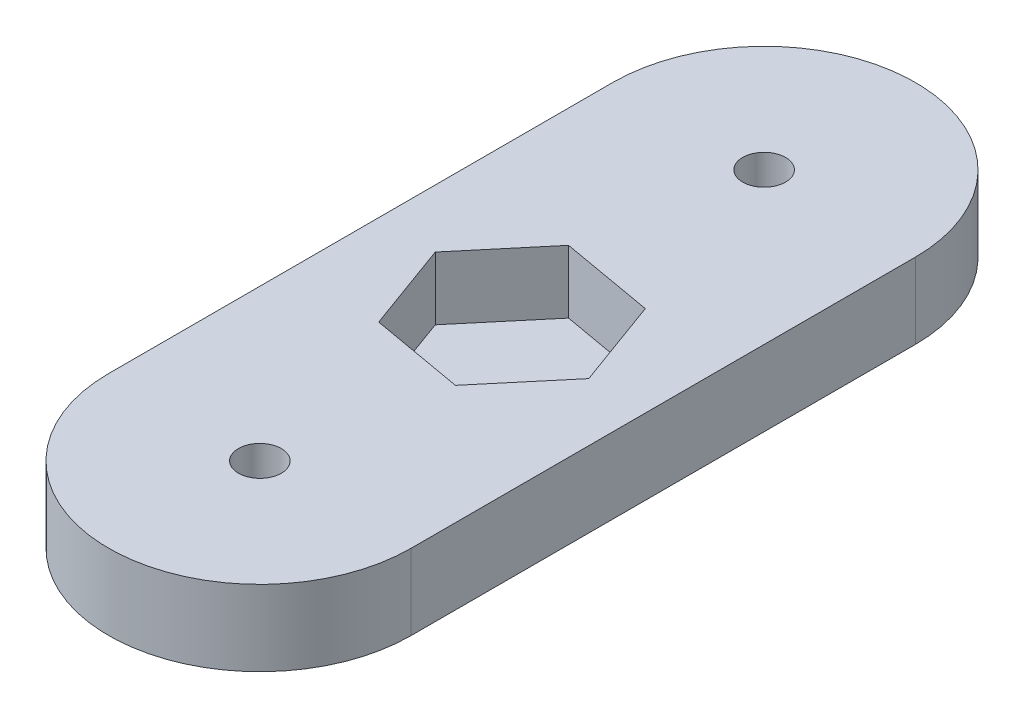
ISO-10303-21;
HEADER;
FILE_DESCRIPTION(('STEP AP214'),'2;1');
FILE_NAME('part.step','',(''),(''),'','','');
FILE_SCHEMA(('AUTOMOTIVE_DESIGN { 1 0 10303 214 1 1 1 1 }'));
ENDSEC;
DATA;
#1=APPLICATION_CONTEXT('core data for automotive mechanical design processes');
#2=APPLICATION_PROTOCOL_DEFINITION('international standard','automotive_design',2000,#1);
#3=PRODUCT_CONTEXT('',#1,'mechanical');
#4=PRODUCT('Part','Part','',(#3));
#5=PRODUCT_RELATED_PRODUCT_CATEGORY('part','',(#4));
#6=PRODUCT_DEFINITION_FORMATION('','',#4);
#7=PRODUCT_DEFINITION_CONTEXT('part definition',#1,'design');
#8=PRODUCT_DEFINITION('design','',#6,#7);
#9=PRODUCT_DEFINITION_SHAPE('','',#8);
#10=(LENGTH_UNIT() NAMED_UNIT(*) SI_UNIT(.MILLI.,.METRE.));
#11=(NAMED_UNIT(*) PLANE_ANGLE_UNIT() SI_UNIT($,.RADIAN.));
#12=(NAMED_UNIT(*) SI_UNIT($,.STERADIAN.) SOLID_ANGLE_UNIT());
#13=UNCERTAINTY_MEASURE_WITH_UNIT(LENGTH_MEASURE(1.E-05),#10,'distance_accuracy_value','');
#14=(GEOMETRIC_REPRESENTATION_CONTEXT(3) GLOBAL_UNCERTAINTY_ASSIGNED_CONTEXT((#13)) GLOBAL_UNIT_ASSIGNED_CONTEXT((#10,
#11,#12)) REPRESENTATION_CONTEXT('',''));
#15=CARTESIAN_POINT('',(0.,0.,0.));
#16=DIRECTION('',(0.,0.,1.));
#17=DIRECTION('',(1.,0.,0.));
#18=AXIS2_PLACEMENT_3D('',#15,#16,#17);
#19=CARTESIAN_POINT('',(0.,6.,0.));
#20=DIRECTION('',(0.,1.,0.));
#21=DIRECTION('',(0.,0.,1.));
#22=AXIS2_PLACEMENT_3D('',#19,#20,#21);
#23=PLANE('',#22);
#24=DIRECTION('',(0.984807753012209,0.,0.173648177666927));
#25=VECTOR('',#24,1.);
#26=CARTESIAN_POINT('',(-4.82447679329562,6.,-14.2504124492025));
#27=LINE('',#26,#25);
#28=CARTESIAN_POINT('',(-4.82447679329562,6.,-14.2504124492025));
#29=VERTEX_POINT('',#28);
#30=CARTESIAN_POINT('',(2.56705048362556,6.,-12.9470867616388));
#31=VERTEX_POINT('',#30);
#32=EDGE_CURVE('E48',#29,#31,#27,.T.);
#33=ORIENTED_EDGE('',*,*,#32,.F.);
#34=DIRECTION('',(0.342020143325672,0.,0.939692620785907));
#35=VECTOR('',#34,1.);
#36=CARTESIAN_POINT('',(-7.39152727692118,6.,-21.3033256875637));
#37=LINE('',#36,#35);
#38=CARTESIAN_POINT('',(-7.39152727692118,6.,-21.3033256875637));
#39=VERTEX_POINT('',#38);
#40=EDGE_CURVE('E140',#39,#29,#37,.T.);
#41=ORIENTED_EDGE('',*,*,#40,.F.);
#42=DIRECTION('',(-0.642787609686537,0.,0.76604444311898));
#43=VECTOR('',#42,1.);
#44=CARTESIAN_POINT('',(-2.56705048362556,6.,-27.0529132383612));
#45=LINE('',#44,#43);
#46=CARTESIAN_POINT('',(-2.56705048362556,6.,-27.0529132383612));
#47=VERTEX_POINT('',#46);
#48=EDGE_CURVE('E143',#47,#39,#45,.T.);
#49=ORIENTED_EDGE('',*,*,#48,.F.);
#50=DIRECTION('',(-0.984807753012209,0.,-0.173648177666927));
#51=VECTOR('',#50,1.);
#52=CARTESIAN_POINT('',(4.82447679329561,6.,-25.7495875507975));
#53=LINE('',#52,#51);
#54=CARTESIAN_POINT('',(4.82447679329561,6.,-25.7495875507975));
#55=VERTEX_POINT('',#54);
#56=EDGE_CURVE('E159',#55,#47,#53,.T.);
#57=ORIENTED_EDGE('',*,*,#56,.F.);
#58=DIRECTION('',(-0.342020143325672,0.,-0.939692620785907));
#59=VECTOR('',#58,1.);
#60=CARTESIAN_POINT('',(7.39152727692118,6.,-18.6966743124362));
#61=LINE('',#60,#59);
#62=CARTESIAN_POINT('',(7.39152727692118,6.,-18.6966743124362));
#63=VERTEX_POINT('',#62);
#64=EDGE_CURVE('E156',#63,#55,#61,.T.);
#65=ORIENTED_EDGE('',*,*,#64,.F.);
#66=DIRECTION('',(0.642787609686537,0.,-0.76604444311898));
#67=VECTOR('',#66,1.);
#68=CARTESIAN_POINT('',(2.56705048362556,6.,-12.9470867616388));
#69=LINE('',#68,#67);
#70=EDGE_CURVE('E154',#31,#63,#69,.T.);
#71=ORIENTED_EDGE('',*,*,#70,.F.);
#72=EDGE_LOOP('',(#33,#41,#49,#57,#65,#71));
#73=FACE_BOUND('',#72,.T.);
#74=CARTESIAN_POINT('',(0.,6.,-40.));
#75=DIRECTION('',(0.,1.,0.));
#76=DIRECTION('',(0.,0.,1.));
#77=AXIS2_PLACEMENT_3D('',#74,#75,#76);
#78=CIRCLE('',#77,1.7);
#79=CARTESIAN_POINT('',(0.,6.,-38.3));
#80=VERTEX_POINT('',#79);
#81=EDGE_CURVE('E180',#80,#80,#78,.T.);
#82=ORIENTED_EDGE('',*,*,#81,.F.);
#83=EDGE_LOOP('',(#82));
#84=FACE_BOUND('',#83,.T.);
#85=CARTESIAN_POINT('',(0.,6.,0.));
#86=DIRECTION('',(0.,1.,0.));
#87=DIRECTION('',(0.,0.,1.));
#88=AXIS2_PLACEMENT_3D('',#85,#86,#87);
#89=CIRCLE('',#88,12.);
#90=CARTESIAN_POINT('',(-12.,6.,0.));
#91=VERTEX_POINT('',#90);
#92=CARTESIAN_POINT('',(12.,6.,0.));
#93=VERTEX_POINT('',#92);
#94=EDGE_CURVE('E186',#91,#93,#89,.T.);
#95=ORIENTED_EDGE('',*,*,#94,.T.);
#96=DIRECTION('',(0.,0.,-1.));
#97=VECTOR('',#96,1.);
#98=CARTESIAN_POINT('',(12.,6.,0.));
#99=LINE('',#98,#97);
#100=CARTESIAN_POINT('',(12.,6.,-40.));
#101=VERTEX_POINT('',#100);
#102=EDGE_CURVE('E85',#93,#101,#99,.T.);
#103=ORIENTED_EDGE('',*,*,#102,.T.);
#104=CARTESIAN_POINT('',(0.,6.,-40.));
#105=DIRECTION('',(0.,1.,0.));
#106=DIRECTION('',(0.,0.,1.));
#107=AXIS2_PLACEMENT_3D('',#104,#105,#106);
#108=CIRCLE('',#107,12.);
#109=CARTESIAN_POINT('',(-12.,6.,-40.));
#110=VERTEX_POINT('',#109);
#111=EDGE_CURVE('E189',#101,#110,#108,.T.);
#112=ORIENTED_EDGE('',*,*,#111,.T.);
#113=DIRECTION('',(0.,0.,1.));
#114=VECTOR('',#113,1.);
#115=CARTESIAN_POINT('',(-12.,6.,0.));
#116=LINE('',#115,#114);
#117=EDGE_CURVE('E57',#110,#91,#116,.T.);
#118=ORIENTED_EDGE('',*,*,#117,.T.);
#119=EDGE_LOOP('',(#95,#103,#112,#118));
#120=FACE_BOUND('',#119,.T.);
#121=CARTESIAN_POINT('',(0.,6.,0.));
#122=DIRECTION('',(0.,1.,0.));
#123=DIRECTION('',(0.,0.,1.));
#124=AXIS2_PLACEMENT_3D('',#121,#122,#123);
#125=CIRCLE('',#124,1.7);
#126=CARTESIAN_POINT('',(0.,6.,1.7));
#127=VERTEX_POINT('',#126);
#128=EDGE_CURVE('E174',#127,#127,#125,.T.);
#129=ORIENTED_EDGE('',*,*,#128,.F.);
#130=EDGE_LOOP('',(#129));
#131=FACE_BOUND('',#130,.T.);
#132=ADVANCED_FACE('F33',(#73,#84,#120,#131),#23,.T.);
#133=CARTESIAN_POINT('',(0.,0.,0.));
#134=DIRECTION('',(0.,1.,0.));
#135=DIRECTION('',(0.,0.,1.));
#136=AXIS2_PLACEMENT_3D('',#133,#134,#135);
#137=PLANE('',#136);
#138=CARTESIAN_POINT('',(0.,0.,-40.));
#139=DIRECTION('',(0.,1.,0.));
#140=DIRECTION('',(0.,0.,1.));
#141=AXIS2_PLACEMENT_3D('',#138,#139,#140);
#142=CIRCLE('',#141,1.7);
#143=CARTESIAN_POINT('',(0.,0.,-38.3));
#144=VERTEX_POINT('',#143);
#145=EDGE_CURVE('E177',#144,#144,#142,.T.);
#146=ORIENTED_EDGE('',*,*,#145,.T.);
#147=EDGE_LOOP('',(#146));
#148=FACE_BOUND('',#147,.T.);
#149=CARTESIAN_POINT('',(0.,0.,0.));
#150=DIRECTION('',(0.,1.,0.));
#151=DIRECTION('',(0.,0.,1.));
#152=AXIS2_PLACEMENT_3D('',#149,#150,#151);
#153=CIRCLE('',#152,12.);
#154=CARTESIAN_POINT('',(-12.,0.,0.));
#155=VERTEX_POINT('',#154);
#156=CARTESIAN_POINT('',(12.,0.,0.));
#157=VERTEX_POINT('',#156);
#158=EDGE_CURVE('E183',#155,#157,#153,.T.);
#159=ORIENTED_EDGE('',*,*,#158,.F.);
#160=DIRECTION('',(0.,0.,1.));
#161=VECTOR('',#160,1.);
#162=CARTESIAN_POINT('',(-12.,0.,0.));
#163=LINE('',#162,#161);
#164=CARTESIAN_POINT('',(-12.,0.,-40.));
#165=VERTEX_POINT('',#164);
#166=EDGE_CURVE('E78',#165,#155,#163,.T.);
#167=ORIENTED_EDGE('',*,*,#166,.F.);
#168=CARTESIAN_POINT('',(0.,0.,-40.));
#169=DIRECTION('',(0.,1.,0.));
#170=DIRECTION('',(0.,0.,1.));
#171=AXIS2_PLACEMENT_3D('',#168,#169,#170);
#172=CIRCLE('',#171,12.);
#173=CARTESIAN_POINT('',(12.,0.,-40.));
#174=VERTEX_POINT('',#173);
#175=EDGE_CURVE('E197',#174,#165,#172,.T.);
#176=ORIENTED_EDGE('',*,*,#175,.F.);
#177=DIRECTION('',(0.,0.,-1.));
#178=VECTOR('',#177,1.);
#179=CARTESIAN_POINT('',(12.,0.,0.));
#180=LINE('',#179,#178);
#181=EDGE_CURVE('E195',#157,#174,#180,.T.);
#182=ORIENTED_EDGE('',*,*,#181,.F.);
#183=EDGE_LOOP('',(#159,#167,#176,#182));
#184=FACE_BOUND('',#183,.T.);
#185=CARTESIAN_POINT('',(0.,0.,0.));
#186=DIRECTION('',(0.,1.,0.));
#187=DIRECTION('',(0.,0.,1.));
#188=AXIS2_PLACEMENT_3D('',#185,#186,#187);
#189=CIRCLE('',#188,1.7);
#190=CARTESIAN_POINT('',(0.,0.,1.7));
#191=VERTEX_POINT('',#190);
#192=EDGE_CURVE('E166',#191,#191,#189,.T.);
#193=ORIENTED_EDGE('',*,*,#192,.T.);
#194=EDGE_LOOP('',(#193));
#195=FACE_BOUND('',#194,.T.);
#196=ADVANCED_FACE('F210',(#148,#184,#195),#137,.F.);
#197=CARTESIAN_POINT('',(0.,6.,0.));
#198=DIRECTION('',(0.,-1.,0.));
#199=DIRECTION('',(0.,0.,-1.));
#200=AXIS2_PLACEMENT_3D('',#197,#198,#199);
#201=CYLINDRICAL_SURFACE('',#200,12.);
#202=ORIENTED_EDGE('',*,*,#158,.T.);
#203=DIRECTION('',(0.,-1.,0.));
#204=VECTOR('',#203,1.);
#205=CARTESIAN_POINT('',(12.,6.,0.));
#206=LINE('',#205,#204);
#207=EDGE_CURVE('E11',#93,#157,#206,.T.);
#208=ORIENTED_EDGE('',*,*,#207,.F.);
#209=ORIENTED_EDGE('',*,*,#94,.F.);
#210=DIRECTION('',(0.,-1.,0.));
#211=VECTOR('',#210,1.);
#212=CARTESIAN_POINT('',(-12.,6.,0.));
#213=LINE('',#212,#211);
#214=EDGE_CURVE('E192',#91,#155,#213,.T.);
#215=ORIENTED_EDGE('',*,*,#214,.T.);
#216=EDGE_LOOP('',(#202,#208,#209,#215));
#217=FACE_BOUND('',#216,.T.);
#218=ADVANCED_FACE('F35',(#217),#201,.T.);
#219=CARTESIAN_POINT('',(12.,6.,0.));
#220=DIRECTION('',(-1.,0.,0.));
#221=DIRECTION('',(0.,0.,1.));
#222=AXIS2_PLACEMENT_3D('',#219,#220,#221);
#223=PLANE('',#222);
#224=ORIENTED_EDGE('',*,*,#181,.T.);
#225=DIRECTION('',(0.,-1.,0.));
#226=VECTOR('',#225,1.);
#227=CARTESIAN_POINT('',(12.,6.,-40.));
#228=LINE('',#227,#226);
#229=EDGE_CURVE('E41',#101,#174,#228,.T.);
#230=ORIENTED_EDGE('',*,*,#229,.F.);
#231=ORIENTED_EDGE('',*,*,#102,.F.);
#232=ORIENTED_EDGE('',*,*,#207,.T.);
#233=EDGE_LOOP('',(#224,#230,#231,#232));
#234=FACE_BOUND('',#233,.T.);
#235=ADVANCED_FACE('F226',(#234),#223,.F.);
#236=CARTESIAN_POINT('',(0.,6.,-40.));
#237=DIRECTION('',(0.,-1.,0.));
#238=DIRECTION('',(0.,0.,-1.));
#239=AXIS2_PLACEMENT_3D('',#236,#237,#238);
#240=CYLINDRICAL_SURFACE('',#239,12.);
#241=ORIENTED_EDGE('',*,*,#175,.T.);
#242=DIRECTION('',(0.,-1.,0.));
#243=VECTOR('',#242,1.);
#244=CARTESIAN_POINT('',(-12.,6.,-40.));
#245=LINE('',#244,#243);
#246=EDGE_CURVE('E201',#110,#165,#245,.T.);
#247=ORIENTED_EDGE('',*,*,#246,.F.);
#248=ORIENTED_EDGE('',*,*,#111,.F.);
#249=ORIENTED_EDGE('',*,*,#229,.T.);
#250=EDGE_LOOP('',(#241,#247,#248,#249));
#251=FACE_BOUND('',#250,.T.);
#252=ADVANCED_FACE('F206',(#251),#240,.T.);
#253=CARTESIAN_POINT('',(-12.,6.,0.));
#254=DIRECTION('',(1.,0.,0.));
#255=DIRECTION('',(0.,0.,-1.));
#256=AXIS2_PLACEMENT_3D('',#253,#254,#255);
#257=PLANE('',#256);
#258=ORIENTED_EDGE('',*,*,#166,.T.);
#259=ORIENTED_EDGE('',*,*,#214,.F.);
#260=ORIENTED_EDGE('',*,*,#117,.F.);
#261=ORIENTED_EDGE('',*,*,#246,.T.);
#262=EDGE_LOOP('',(#258,#259,#260,#261));
#263=FACE_BOUND('',#262,.T.);
#264=ADVANCED_FACE('F215',(#263),#257,.F.);
#265=CARTESIAN_POINT('',(0.,6.,-40.));
#266=DIRECTION('',(0.,-1.,0.));
#267=DIRECTION('',(0.,0.,-1.));
#268=AXIS2_PLACEMENT_3D('',#265,#266,#267);
#269=CYLINDRICAL_SURFACE('',#268,1.7);
#270=ORIENTED_EDGE('',*,*,#81,.T.);
#271=EDGE_LOOP('',(#270));
#272=FACE_BOUND('',#271,.T.);
#273=ORIENTED_EDGE('',*,*,#145,.F.);
#274=EDGE_LOOP('',(#273));
#275=FACE_BOUND('',#274,.T.);
#276=ADVANCED_FACE('F217',(#272,#275),#269,.F.);
#277=CARTESIAN_POINT('',(0.,6.,0.));
#278=DIRECTION('',(0.,-1.,0.));
#279=DIRECTION('',(0.,0.,-1.));
#280=AXIS2_PLACEMENT_3D('',#277,#278,#279);
#281=CYLINDRICAL_SURFACE('',#280,1.7);
#282=ORIENTED_EDGE('',*,*,#128,.T.);
#283=EDGE_LOOP('',(#282));
#284=FACE_BOUND('',#283,.T.);
#285=ORIENTED_EDGE('',*,*,#192,.F.);
#286=EDGE_LOOP('',(#285));
#287=FACE_BOUND('',#286,.T.);
#288=ADVANCED_FACE('F223',(#284,#287),#281,.F.);
#289=CARTESIAN_POINT('',(-4.82447679329562,1.,-14.2504124492025));
#290=DIRECTION('',(-0.173648177666927,0.,0.984807753012209));
#291=DIRECTION('',(0.984807753012209,0.,0.173648177666927));
#292=AXIS2_PLACEMENT_3D('',#289,#290,#291);
#293=PLANE('',#292);
#294=ORIENTED_EDGE('',*,*,#32,.T.);
#295=DIRECTION('',(0.,1.,0.));
#296=VECTOR('',#295,1.);
#297=CARTESIAN_POINT('',(2.56705048362556,1.,-12.9470867616388));
#298=LINE('',#297,#296);
#299=CARTESIAN_POINT('',(2.56705048362556,1.,-12.9470867616388));
#300=VERTEX_POINT('',#299);
#301=EDGE_CURVE('E117',#300,#31,#298,.T.);
#302=ORIENTED_EDGE('',*,*,#301,.F.);
#303=DIRECTION('',(0.984807753012209,0.,0.173648177666927));
#304=VECTOR('',#303,1.);
#305=CARTESIAN_POINT('',(-4.82447679329562,1.,-14.2504124492025));
#306=LINE('',#305,#304);
#307=CARTESIAN_POINT('',(-4.82447679329562,1.,-14.2504124492025));
#308=VERTEX_POINT('',#307);
#309=EDGE_CURVE('E121',#308,#300,#306,.T.);
#310=ORIENTED_EDGE('',*,*,#309,.F.);
#311=DIRECTION('',(0.,1.,0.));
#312=VECTOR('',#311,1.);
#313=CARTESIAN_POINT('',(-4.82447679329562,1.,-14.2504124492025));
#314=LINE('',#313,#312);
#315=EDGE_CURVE('E164',#308,#29,#314,.T.);
#316=ORIENTED_EDGE('',*,*,#315,.T.);
#317=EDGE_LOOP('',(#294,#302,#310,#316));
#318=FACE_BOUND('',#317,.T.);
#319=ADVANCED_FACE('F119',(#318),#293,.F.);
#320=CARTESIAN_POINT('',(-7.39152727692118,1.,-21.3033256875637));
#321=DIRECTION('',(-0.939692620785907,0.,0.342020143325672));
#322=DIRECTION('',(0.342020143325672,0.,0.939692620785907));
#323=AXIS2_PLACEMENT_3D('',#320,#321,#322);
#324=PLANE('',#323);
#325=ORIENTED_EDGE('',*,*,#40,.T.);
#326=ORIENTED_EDGE('',*,*,#315,.F.);
#327=DIRECTION('',(0.342020143325672,0.,0.939692620785907));
#328=VECTOR('',#327,1.);
#329=CARTESIAN_POINT('',(-7.39152727692118,1.,-21.3033256875637));
#330=LINE('',#329,#328);
#331=CARTESIAN_POINT('',(-7.39152727692118,1.,-21.3033256875637));
#332=VERTEX_POINT('',#331);
#333=EDGE_CURVE('E127',#332,#308,#330,.T.);
#334=ORIENTED_EDGE('',*,*,#333,.F.);
#335=DIRECTION('',(0.,1.,0.));
#336=VECTOR('',#335,1.);
#337=CARTESIAN_POINT('',(-7.39152727692118,1.,-21.3033256875637));
#338=LINE('',#337,#336);
#339=EDGE_CURVE('E167',#332,#39,#338,.T.);
#340=ORIENTED_EDGE('',*,*,#339,.T.);
#341=EDGE_LOOP('',(#325,#326,#334,#340));
#342=FACE_BOUND('',#341,.T.);
#343=ADVANCED_FACE('F243',(#342),#324,.F.);
#344=CARTESIAN_POINT('',(-2.56705048362556,1.,-27.0529132383612));
#345=DIRECTION('',(-0.76604444311898,0.,-0.642787609686537));
#346=DIRECTION('',(-0.642787609686537,0.,0.76604444311898));
#347=AXIS2_PLACEMENT_3D('',#344,#345,#346);
#348=PLANE('',#347);
#349=ORIENTED_EDGE('',*,*,#48,.T.);
#350=ORIENTED_EDGE('',*,*,#339,.F.);
#351=DIRECTION('',(-0.642787609686537,0.,0.76604444311898));
#352=VECTOR('',#351,1.);
#353=CARTESIAN_POINT('',(-2.56705048362556,1.,-27.0529132383612));
#354=LINE('',#353,#352);
#355=CARTESIAN_POINT('',(-2.56705048362556,1.,-27.0529132383612));
#356=VERTEX_POINT('',#355);
#357=EDGE_CURVE('E150',#356,#332,#354,.T.);
#358=ORIENTED_EDGE('',*,*,#357,.F.);
#359=DIRECTION('',(0.,1.,0.));
#360=VECTOR('',#359,1.);
#361=CARTESIAN_POINT('',(-2.56705048362556,1.,-27.0529132383612));
#362=LINE('',#361,#360);
#363=EDGE_CURVE('E169',#356,#47,#362,.T.);
#364=ORIENTED_EDGE('',*,*,#363,.T.);
#365=EDGE_LOOP('',(#349,#350,#358,#364));
#366=FACE_BOUND('',#365,.T.);
#367=ADVANCED_FACE('F253',(#366),#348,.F.);
#368=CARTESIAN_POINT('',(4.82447679329561,1.,-25.7495875507975));
#369=DIRECTION('',(0.173648177666927,0.,-0.984807753012209));
#370=DIRECTION('',(-0.984807753012209,0.,-0.173648177666927));
#371=AXIS2_PLACEMENT_3D('',#368,#369,#370);
#372=PLANE('',#371);
#373=ORIENTED_EDGE('',*,*,#56,.T.);
#374=ORIENTED_EDGE('',*,*,#363,.F.);
#375=DIRECTION('',(-0.984807753012209,0.,-0.173648177666927));
#376=VECTOR('',#375,1.);
#377=CARTESIAN_POINT('',(4.82447679329561,1.,-25.7495875507975));
#378=LINE('',#377,#376);
#379=CARTESIAN_POINT('',(4.82447679329561,1.,-25.7495875507975));
#380=VERTEX_POINT('',#379);
#381=EDGE_CURVE('E147',#380,#356,#378,.T.);
#382=ORIENTED_EDGE('',*,*,#381,.F.);
#383=DIRECTION('',(0.,1.,0.));
#384=VECTOR('',#383,1.);
#385=CARTESIAN_POINT('',(4.82447679329561,1.,-25.7495875507975));
#386=LINE('',#385,#384);
#387=EDGE_CURVE('E171',#380,#55,#386,.T.);
#388=ORIENTED_EDGE('',*,*,#387,.T.);
#389=EDGE_LOOP('',(#373,#374,#382,#388));
#390=FACE_BOUND('',#389,.T.);
#391=ADVANCED_FACE('F249',(#390),#372,.F.);
#392=CARTESIAN_POINT('',(7.39152727692118,1.,-18.6966743124362));
#393=DIRECTION('',(0.939692620785907,0.,-0.342020143325672));
#394=DIRECTION('',(-0.342020143325672,0.,-0.939692620785907));
#395=AXIS2_PLACEMENT_3D('',#392,#393,#394);
#396=PLANE('',#395);
#397=ORIENTED_EDGE('',*,*,#64,.T.);
#398=ORIENTED_EDGE('',*,*,#387,.F.);
#399=DIRECTION('',(-0.342020143325672,0.,-0.939692620785907));
#400=VECTOR('',#399,1.);
#401=CARTESIAN_POINT('',(7.39152727692118,1.,-18.6966743124362));
#402=LINE('',#401,#400);
#403=CARTESIAN_POINT('',(7.39152727692118,1.,-18.6966743124362));
#404=VERTEX_POINT('',#403);
#405=EDGE_CURVE('E135',#404,#380,#402,.T.);
#406=ORIENTED_EDGE('',*,*,#405,.F.);
#407=DIRECTION('',(0.,1.,0.));
#408=VECTOR('',#407,1.);
#409=CARTESIAN_POINT('',(7.39152727692118,1.,-18.6966743124362));
#410=LINE('',#409,#408);
#411=EDGE_CURVE('E126',#404,#63,#410,.T.);
#412=ORIENTED_EDGE('',*,*,#411,.T.);
#413=EDGE_LOOP('',(#397,#398,#406,#412));
#414=FACE_BOUND('',#413,.T.);
#415=ADVANCED_FACE('F246',(#414),#396,.F.);
#416=CARTESIAN_POINT('',(2.56705048362556,1.,-12.9470867616388));
#417=DIRECTION('',(0.76604444311898,0.,0.642787609686537));
#418=DIRECTION('',(0.642787609686537,0.,-0.76604444311898));
#419=AXIS2_PLACEMENT_3D('',#416,#417,#418);
#420=PLANE('',#419);
#421=ORIENTED_EDGE('',*,*,#70,.T.);
#422=ORIENTED_EDGE('',*,*,#411,.F.);
#423=DIRECTION('',(0.642787609686537,0.,-0.76604444311898));
#424=VECTOR('',#423,1.);
#425=CARTESIAN_POINT('',(2.56705048362556,1.,-12.9470867616388));
#426=LINE('',#425,#424);
#427=EDGE_CURVE('E130',#300,#404,#426,.T.);
#428=ORIENTED_EDGE('',*,*,#427,.F.);
#429=ORIENTED_EDGE('',*,*,#301,.T.);
#430=EDGE_LOOP('',(#421,#422,#428,#429));
#431=FACE_BOUND('',#430,.T.);
#432=ADVANCED_FACE('F131',(#431),#420,.F.);
#433=CARTESIAN_POINT('',(0.,1.,0.));
#434=DIRECTION('',(0.,1.,0.));
#435=DIRECTION('',(0.,0.,1.));
#436=AXIS2_PLACEMENT_3D('',#433,#434,#435);
#437=PLANE('',#436);
#438=ORIENTED_EDGE('',*,*,#309,.T.);
#439=ORIENTED_EDGE('',*,*,#427,.T.);
#440=ORIENTED_EDGE('',*,*,#405,.T.);
#441=ORIENTED_EDGE('',*,*,#381,.T.);
#442=ORIENTED_EDGE('',*,*,#357,.T.);
#443=ORIENTED_EDGE('',*,*,#333,.T.);
#444=EDGE_LOOP('',(#438,#439,#440,#441,#442,#443));
#445=FACE_BOUND('',#444,.T.);
#446=ADVANCED_FACE('F137',(#445),#437,.T.);
#447=CLOSED_SHELL('',(#132,#196,#218,#235,#252,#264,#276,#288,#319,#343,#367,#391,#415,#432,#446));
#448=MANIFOLD_SOLID_BREP('B2',#447);
#449=ADVANCED_BREP_SHAPE_REPRESENTATION('',(#18,#448),#14);
#450=SHAPE_DEFINITION_REPRESENTATION(#9,#449);
ENDSEC;
END-ISO-10303-21;
